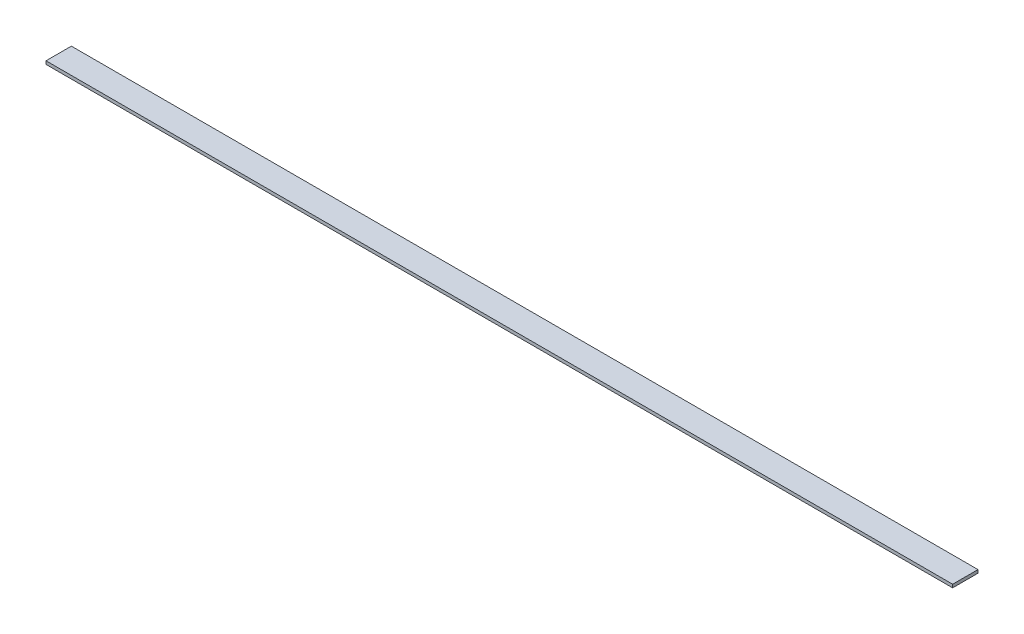
ISO-10303-21;
HEADER;
FILE_DESCRIPTION(('STEP AP214'),'2;1');
FILE_NAME('part.step','',(''),(''),'','','');
FILE_SCHEMA(('AUTOMOTIVE_DESIGN { 1 0 10303 214 1 1 1 1 }'));
ENDSEC;
DATA;
#1=APPLICATION_CONTEXT('core data for automotive mechanical design processes');
#2=APPLICATION_PROTOCOL_DEFINITION('international standard','automotive_design',2000,#1);
#3=PRODUCT_CONTEXT('',#1,'mechanical');
#4=PRODUCT('Part','Part','',(#3));
#5=PRODUCT_RELATED_PRODUCT_CATEGORY('part','',(#4));
#6=PRODUCT_DEFINITION_FORMATION('','',#4);
#7=PRODUCT_DEFINITION_CONTEXT('part definition',#1,'design');
#8=PRODUCT_DEFINITION('design','',#6,#7);
#9=PRODUCT_DEFINITION_SHAPE('','',#8);
#10=(LENGTH_UNIT() NAMED_UNIT(*) SI_UNIT(.MILLI.,.METRE.));
#11=(NAMED_UNIT(*) PLANE_ANGLE_UNIT() SI_UNIT($,.RADIAN.));
#12=(NAMED_UNIT(*) SI_UNIT($,.STERADIAN.) SOLID_ANGLE_UNIT());
#13=UNCERTAINTY_MEASURE_WITH_UNIT(LENGTH_MEASURE(1.E-05),#10,'distance_accuracy_value','');
#14=(GEOMETRIC_REPRESENTATION_CONTEXT(3) GLOBAL_UNCERTAINTY_ASSIGNED_CONTEXT((#13)) GLOBAL_UNIT_ASSIGNED_CONTEXT((#10,
#11,#12)) REPRESENTATION_CONTEXT('',''));
#15=CARTESIAN_POINT('',(0.,0.,0.));
#16=DIRECTION('',(0.,0.,1.));
#17=DIRECTION('',(1.,0.,0.));
#18=AXIS2_PLACEMENT_3D('',#15,#16,#17);
#19=CARTESIAN_POINT('',(0.,6.35,0.));
#20=DIRECTION('',(1.,0.,0.));
#21=DIRECTION('',(0.,0.,-1.));
#22=AXIS2_PLACEMENT_3D('',#19,#20,#21);
#23=PLANE('',#22);
#24=DIRECTION('',(0.,0.,1.));
#25=VECTOR('',#24,1.);
#26=CARTESIAN_POINT('',(0.,0.,0.));
#27=LINE('',#26,#25);
#28=CARTESIAN_POINT('',(0.,0.,-50.8));
#29=VERTEX_POINT('',#28);
#30=CARTESIAN_POINT('',(0.,0.,0.));
#31=VERTEX_POINT('',#30);
#32=EDGE_CURVE('E80',#29,#31,#27,.T.);
#33=ORIENTED_EDGE('',*,*,#32,.T.);
#34=DIRECTION('',(0.,-1.,0.));
#35=VECTOR('',#34,1.);
#36=CARTESIAN_POINT('',(0.,6.35,0.));
#37=LINE('',#36,#35);
#38=CARTESIAN_POINT('',(0.,6.35,0.));
#39=VERTEX_POINT('',#38);
#40=EDGE_CURVE('E11',#39,#31,#37,.T.);
#41=ORIENTED_EDGE('',*,*,#40,.F.);
#42=DIRECTION('',(0.,0.,1.));
#43=VECTOR('',#42,1.);
#44=CARTESIAN_POINT('',(0.,6.35,0.));
#45=LINE('',#44,#43);
#46=CARTESIAN_POINT('',(0.,6.35,-50.8));
#47=VERTEX_POINT('',#46);
#48=EDGE_CURVE('E68',#47,#39,#45,.T.);
#49=ORIENTED_EDGE('',*,*,#48,.F.);
#50=DIRECTION('',(0.,-1.,0.));
#51=VECTOR('',#50,1.);
#52=CARTESIAN_POINT('',(0.,6.35,-50.8));
#53=LINE('',#52,#51);
#54=EDGE_CURVE('E76',#47,#29,#53,.T.);
#55=ORIENTED_EDGE('',*,*,#54,.T.);
#56=EDGE_LOOP('',(#33,#41,#49,#55));
#57=FACE_BOUND('',#56,.T.);
#58=ADVANCED_FACE('F17',(#57),#23,.F.);
#59=CARTESIAN_POINT('',(0.,6.35,0.));
#60=DIRECTION('',(0.,0.,-1.));
#61=DIRECTION('',(-1.,0.,0.));
#62=AXIS2_PLACEMENT_3D('',#59,#60,#61);
#63=PLANE('',#62);
#64=DIRECTION('',(1.,0.,0.));
#65=VECTOR('',#64,1.);
#66=CARTESIAN_POINT('',(0.,0.,0.));
#67=LINE('',#66,#65);
#68=CARTESIAN_POINT('',(1816.1,0.,0.));
#69=VERTEX_POINT('',#68);
#70=EDGE_CURVE('E72',#31,#69,#67,.T.);
#71=ORIENTED_EDGE('',*,*,#70,.T.);
#72=DIRECTION('',(0.,-1.,0.));
#73=VECTOR('',#72,1.);
#74=CARTESIAN_POINT('',(1816.1,6.35,0.));
#75=LINE('',#74,#73);
#76=CARTESIAN_POINT('',(1816.1,6.35,0.));
#77=VERTEX_POINT('',#76);
#78=EDGE_CURVE('E25',#77,#69,#75,.T.);
#79=ORIENTED_EDGE('',*,*,#78,.F.);
#80=DIRECTION('',(1.,0.,0.));
#81=VECTOR('',#80,1.);
#82=CARTESIAN_POINT('',(0.,6.35,0.));
#83=LINE('',#82,#81);
#84=EDGE_CURVE('E63',#39,#77,#83,.T.);
#85=ORIENTED_EDGE('',*,*,#84,.F.);
#86=ORIENTED_EDGE('',*,*,#40,.T.);
#87=EDGE_LOOP('',(#71,#79,#85,#86));
#88=FACE_BOUND('',#87,.T.);
#89=ADVANCED_FACE('F71',(#88),#63,.F.);
#90=CARTESIAN_POINT('',(1816.1,6.35,0.));
#91=DIRECTION('',(-1.,0.,0.));
#92=DIRECTION('',(0.,0.,1.));
#93=AXIS2_PLACEMENT_3D('',#90,#91,#92);
#94=PLANE('',#93);
#95=DIRECTION('',(0.,0.,-1.));
#96=VECTOR('',#95,1.);
#97=CARTESIAN_POINT('',(1816.1,0.,0.));
#98=LINE('',#97,#96);
#99=CARTESIAN_POINT('',(1816.1,0.,-50.8));
#100=VERTEX_POINT('',#99);
#101=EDGE_CURVE('E50',#69,#100,#98,.T.);
#102=ORIENTED_EDGE('',*,*,#101,.T.);
#103=DIRECTION('',(0.,-1.,0.));
#104=VECTOR('',#103,1.);
#105=CARTESIAN_POINT('',(1816.1,6.35,-50.8));
#106=LINE('',#105,#104);
#107=CARTESIAN_POINT('',(1816.1,6.35,-50.8));
#108=VERTEX_POINT('',#107);
#109=EDGE_CURVE('E73',#108,#100,#106,.T.);
#110=ORIENTED_EDGE('',*,*,#109,.F.);
#111=DIRECTION('',(0.,0.,-1.));
#112=VECTOR('',#111,1.);
#113=CARTESIAN_POINT('',(1816.1,6.35,0.));
#114=LINE('',#113,#112);
#115=EDGE_CURVE('E66',#77,#108,#114,.T.);
#116=ORIENTED_EDGE('',*,*,#115,.F.);
#117=ORIENTED_EDGE('',*,*,#78,.T.);
#118=EDGE_LOOP('',(#102,#110,#116,#117));
#119=FACE_BOUND('',#118,.T.);
#120=ADVANCED_FACE('F74',(#119),#94,.F.);
#121=CARTESIAN_POINT('',(0.,6.35,-50.8));
#122=DIRECTION('',(0.,0.,1.));
#123=DIRECTION('',(1.,0.,0.));
#124=AXIS2_PLACEMENT_3D('',#121,#122,#123);
#125=PLANE('',#124);
#126=DIRECTION('',(-1.,0.,0.));
#127=VECTOR('',#126,1.);
#128=CARTESIAN_POINT('',(0.,0.,-50.8));
#129=LINE('',#128,#127);
#130=EDGE_CURVE('E56',#100,#29,#129,.T.);
#131=ORIENTED_EDGE('',*,*,#130,.T.);
#132=ORIENTED_EDGE('',*,*,#54,.F.);
#133=DIRECTION('',(-1.,0.,0.));
#134=VECTOR('',#133,1.);
#135=CARTESIAN_POINT('',(0.,6.35,-50.8));
#136=LINE('',#135,#134);
#137=EDGE_CURVE('E33',#108,#47,#136,.T.);
#138=ORIENTED_EDGE('',*,*,#137,.F.);
#139=ORIENTED_EDGE('',*,*,#109,.T.);
#140=EDGE_LOOP('',(#131,#132,#138,#139));
#141=FACE_BOUND('',#140,.T.);
#142=ADVANCED_FACE('F87',(#141),#125,.F.);
#143=CARTESIAN_POINT('',(0.,6.35,-50.8));
#144=DIRECTION('',(0.,-1.,0.));
#145=DIRECTION('',(0.,0.,-1.));
#146=AXIS2_PLACEMENT_3D('',#143,#144,#145);
#147=PLANE('',#146);
#148=ORIENTED_EDGE('',*,*,#48,.T.);
#149=ORIENTED_EDGE('',*,*,#84,.T.);
#150=ORIENTED_EDGE('',*,*,#115,.T.);
#151=ORIENTED_EDGE('',*,*,#137,.T.);
#152=EDGE_LOOP('',(#148,#149,#150,#151));
#153=FACE_BOUND('',#152,.T.);
#154=ADVANCED_FACE('F64',(#153),#147,.F.);
#155=CARTESIAN_POINT('',(0.,0.,-50.8));
#156=DIRECTION('',(0.,-1.,0.));
#157=DIRECTION('',(0.,0.,-1.));
#158=AXIS2_PLACEMENT_3D('',#155,#156,#157);
#159=PLANE('',#158);
#160=ORIENTED_EDGE('',*,*,#32,.F.);
#161=ORIENTED_EDGE('',*,*,#130,.F.);
#162=ORIENTED_EDGE('',*,*,#101,.F.);
#163=ORIENTED_EDGE('',*,*,#70,.F.);
#164=EDGE_LOOP('',(#160,#161,#162,#163));
#165=FACE_BOUND('',#164,.T.);
#166=ADVANCED_FACE('F90',(#165),#159,.T.);
#167=CLOSED_SHELL('',(#58,#89,#120,#142,#154,#166));
#168=MANIFOLD_SOLID_BREP('B1',#167);
#169=ADVANCED_BREP_SHAPE_REPRESENTATION('',(#18,#168),#14);
#170=SHAPE_DEFINITION_REPRESENTATION(#9,#169);
ENDSEC;
END-ISO-10303-21;
